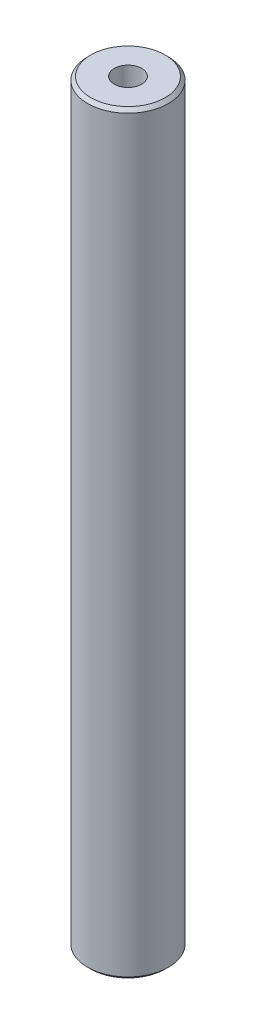
ISO-10303-21;
HEADER;
FILE_DESCRIPTION(('STEP AP214'),'2;1');
FILE_NAME('part.step','',(''),(''),'','','');
FILE_SCHEMA(('AUTOMOTIVE_DESIGN { 1 0 10303 214 1 1 1 1 }'));
ENDSEC;
DATA;
#1=APPLICATION_CONTEXT('core data for automotive mechanical design processes');
#2=APPLICATION_PROTOCOL_DEFINITION('international standard','automotive_design',2000,#1);
#3=PRODUCT_CONTEXT('',#1,'mechanical');
#4=PRODUCT('Part','Part','',(#3));
#5=PRODUCT_RELATED_PRODUCT_CATEGORY('part','',(#4));
#6=PRODUCT_DEFINITION_FORMATION('','',#4);
#7=PRODUCT_DEFINITION_CONTEXT('part definition',#1,'design');
#8=PRODUCT_DEFINITION('design','',#6,#7);
#9=PRODUCT_DEFINITION_SHAPE('','',#8);
#10=(LENGTH_UNIT() NAMED_UNIT(*) SI_UNIT(.MILLI.,.METRE.));
#11=(NAMED_UNIT(*) PLANE_ANGLE_UNIT() SI_UNIT($,.RADIAN.));
#12=(NAMED_UNIT(*) SI_UNIT($,.STERADIAN.) SOLID_ANGLE_UNIT());
#13=UNCERTAINTY_MEASURE_WITH_UNIT(LENGTH_MEASURE(1.E-05),#10,'distance_accuracy_value','');
#14=(GEOMETRIC_REPRESENTATION_CONTEXT(3) GLOBAL_UNCERTAINTY_ASSIGNED_CONTEXT((#13)) GLOBAL_UNIT_ASSIGNED_CONTEXT((#10,
#11,#12)) REPRESENTATION_CONTEXT('',''));
#15=CARTESIAN_POINT('',(0.,0.,0.));
#16=DIRECTION('',(0.,0.,1.));
#17=DIRECTION('',(1.,0.,0.));
#18=AXIS2_PLACEMENT_3D('',#15,#16,#17);
#19=CARTESIAN_POINT('',(0.,466.85479025984,0.));
#20=DIRECTION('',(0.,-1.,0.));
#21=DIRECTION('',(0.,0.,-1.));
#22=AXIS2_PLACEMENT_3D('',#19,#20,#21);
#23=CYLINDRICAL_SURFACE('',#22,25.);
#24=CARTESIAN_POINT('',(0.,464.757550156895,0.));
#25=DIRECTION('',(0.,1.,0.));
#26=DIRECTION('',(0.,0.,1.));
#27=AXIS2_PLACEMENT_3D('',#24,#25,#26);
#28=CIRCLE('',#27,25.);
#29=CARTESIAN_POINT('',(0.,464.757550156895,25.));
#30=VERTEX_POINT('',#29);
#31=EDGE_CURVE('E50',#30,#30,#28,.F.);
#32=ORIENTED_EDGE('',*,*,#31,.T.);
#33=EDGE_LOOP('',(#32));
#34=FACE_BOUND('',#33,.T.);
#35=CARTESIAN_POINT('',(0.,2.04218223122549,0.));
#36=DIRECTION('',(0.,1.,0.));
#37=DIRECTION('',(0.,0.,1.));
#38=AXIS2_PLACEMENT_3D('',#35,#36,#37);
#39=CIRCLE('',#38,25.);
#40=CARTESIAN_POINT('',(0.,2.04218223122549,25.));
#41=VERTEX_POINT('',#40);
#42=EDGE_CURVE('E51',#41,#41,#39,.T.);
#43=ORIENTED_EDGE('',*,*,#42,.T.);
#44=EDGE_LOOP('',(#43));
#45=FACE_BOUND('',#44,.T.);
#46=ADVANCED_FACE('F39',(#34,#45),#23,.T.);
#47=CARTESIAN_POINT('',(0.,466.85479025984,0.));
#48=DIRECTION('',(0.,1.,0.));
#49=DIRECTION('',(0.,0.,1.));
#50=AXIS2_PLACEMENT_3D('',#47,#48,#49);
#51=PLANE('',#50);
#52=CARTESIAN_POINT('',(0.,466.85479025984,0.));
#53=DIRECTION('',(0.,1.,0.));
#54=DIRECTION('',(0.,0.,1.));
#55=AXIS2_PLACEMENT_3D('',#52,#53,#54);
#56=CIRCLE('',#55,22.9578177687745);
#57=CARTESIAN_POINT('',(0.,466.85479025984,22.9578177687745));
#58=VERTEX_POINT('',#57);
#59=EDGE_CURVE('E54',#58,#58,#56,.T.);
#60=ORIENTED_EDGE('',*,*,#59,.T.);
#61=EDGE_LOOP('',(#60));
#62=FACE_BOUND('',#61,.T.);
#63=CARTESIAN_POINT('',(0.,466.85479025984,0.));
#64=DIRECTION('',(0.,1.,0.));
#65=DIRECTION('',(0.,0.,1.));
#66=AXIS2_PLACEMENT_3D('',#63,#64,#65);
#67=CIRCLE('',#66,8.48262149382811);
#68=CARTESIAN_POINT('',(0.,466.85479025984,8.48262149382811));
#69=VERTEX_POINT('',#68);
#70=EDGE_CURVE('E58',#69,#69,#67,.T.);
#71=ORIENTED_EDGE('',*,*,#70,.F.);
#72=EDGE_LOOP('',(#71));
#73=FACE_BOUND('',#72,.T.);
#74=ADVANCED_FACE('F69',(#62,#73),#51,.T.);
#75=CARTESIAN_POINT('',(0.,0.,0.));
#76=DIRECTION('',(0.,1.,0.));
#77=DIRECTION('',(0.,0.,1.));
#78=AXIS2_PLACEMENT_3D('',#75,#76,#77);
#79=PLANE('',#78);
#80=CARTESIAN_POINT('',(0.,0.,0.));
#81=DIRECTION('',(0.,1.,0.));
#82=DIRECTION('',(0.,0.,1.));
#83=AXIS2_PLACEMENT_3D('',#80,#81,#82);
#84=CIRCLE('',#83,22.9027598970554);
#85=CARTESIAN_POINT('',(0.,0.,22.9027598970554));
#86=VERTEX_POINT('',#85);
#87=EDGE_CURVE('E10',#86,#86,#84,.F.);
#88=ORIENTED_EDGE('',*,*,#87,.T.);
#89=EDGE_LOOP('',(#88));
#90=FACE_BOUND('',#89,.T.);
#91=CARTESIAN_POINT('',(0.,0.,0.));
#92=DIRECTION('',(0.,1.,0.));
#93=DIRECTION('',(0.,0.,1.));
#94=AXIS2_PLACEMENT_3D('',#91,#92,#93);
#95=CIRCLE('',#94,8.48262149382811);
#96=CARTESIAN_POINT('',(0.,0.,8.48262149382811));
#97=VERTEX_POINT('',#96);
#98=EDGE_CURVE('E63',#97,#97,#95,.T.);
#99=ORIENTED_EDGE('',*,*,#98,.T.);
#100=EDGE_LOOP('',(#99));
#101=FACE_BOUND('',#100,.T.);
#102=ADVANCED_FACE('F75',(#90,#101),#79,.F.);
#103=CARTESIAN_POINT('',(0.,466.85479025984,0.));
#104=DIRECTION('',(0.,-1.,0.));
#105=DIRECTION('',(0.,0.,-1.));
#106=AXIS2_PLACEMENT_3D('',#103,#104,#105);
#107=CYLINDRICAL_SURFACE('',#106,8.48262149382811);
#108=ORIENTED_EDGE('',*,*,#70,.T.);
#109=EDGE_LOOP('',(#108));
#110=FACE_BOUND('',#109,.T.);
#111=ORIENTED_EDGE('',*,*,#98,.F.);
#112=EDGE_LOOP('',(#111));
#113=FACE_BOUND('',#112,.T.);
#114=ADVANCED_FACE('F70',(#110,#113),#107,.F.);
#115=CARTESIAN_POINT('',(0.,466.85479025984,0.));
#116=DIRECTION('',(0.,-1.,0.));
#117=DIRECTION('',(0.,0.,-1.));
#118=AXIS2_PLACEMENT_3D('',#115,#116,#117);
#119=CONICAL_SURFACE('',#118,22.9578177687745,0.772098088941554);
#120=ORIENTED_EDGE('',*,*,#31,.F.);
#121=EDGE_LOOP('',(#120));
#122=FACE_BOUND('',#121,.T.);
#123=ORIENTED_EDGE('',*,*,#59,.F.);
#124=EDGE_LOOP('',(#123));
#125=FACE_BOUND('',#124,.T.);
#126=ADVANCED_FACE('F81',(#122,#125),#119,.T.);
#127=CARTESIAN_POINT('',(0.,2.04218223122549,0.));
#128=DIRECTION('',(0.,1.,0.));
#129=DIRECTION('',(0.,0.,1.));
#130=AXIS2_PLACEMENT_3D('',#127,#128,#129);
#131=CONICAL_SURFACE('',#130,25.,0.798698237853347);
#132=ORIENTED_EDGE('',*,*,#87,.F.);
#133=EDGE_LOOP('',(#132));
#134=FACE_BOUND('',#133,.T.);
#135=ORIENTED_EDGE('',*,*,#42,.F.);
#136=EDGE_LOOP('',(#135));
#137=FACE_BOUND('',#136,.T.);
#138=ADVANCED_FACE('F45',(#134,#137),#131,.T.);
#139=CLOSED_SHELL('',(#46,#74,#102,#114,#126,#138));
#140=MANIFOLD_SOLID_BREP('B2',#139);
#141=ADVANCED_BREP_SHAPE_REPRESENTATION('',(#18,#140),#14);
#142=SHAPE_DEFINITION_REPRESENTATION(#9,#141);
ENDSEC;
END-ISO-10303-21;
